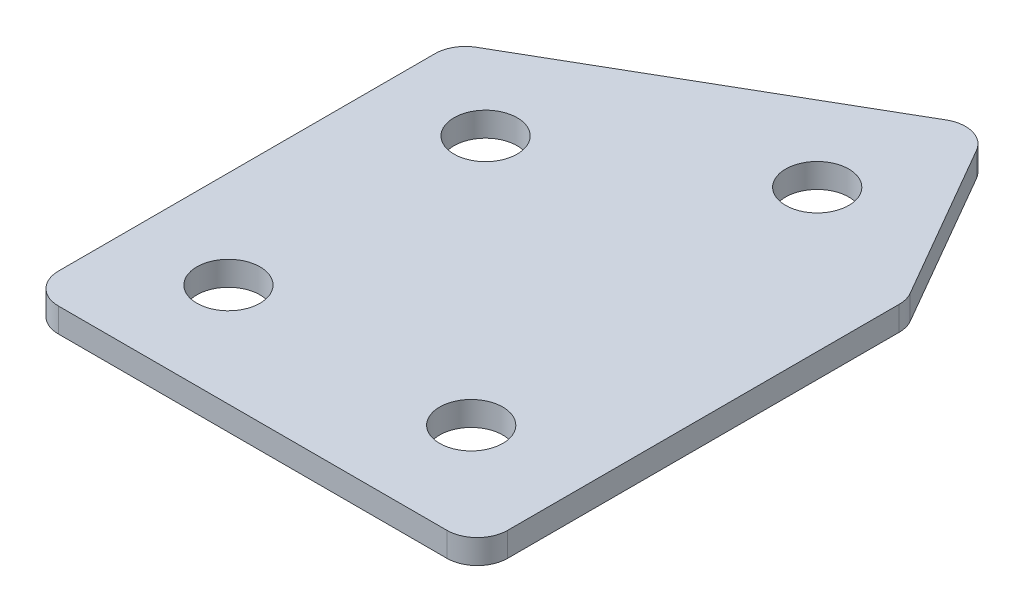
ISO-10303-21;
HEADER;
FILE_DESCRIPTION(('STEP AP214'),'2;1');
FILE_NAME('part.step','',(''),(''),'','','');
FILE_SCHEMA(('AUTOMOTIVE_DESIGN { 1 0 10303 214 1 1 1 1 }'));
ENDSEC;
DATA;
#1=APPLICATION_CONTEXT('core data for automotive mechanical design processes');
#2=APPLICATION_PROTOCOL_DEFINITION('international standard','automotive_design',2000,#1);
#3=PRODUCT_CONTEXT('',#1,'mechanical');
#4=PRODUCT('Part','Part','',(#3));
#5=PRODUCT_RELATED_PRODUCT_CATEGORY('part','',(#4));
#6=PRODUCT_DEFINITION_FORMATION('','',#4);
#7=PRODUCT_DEFINITION_CONTEXT('part definition',#1,'design');
#8=PRODUCT_DEFINITION('design','',#6,#7);
#9=PRODUCT_DEFINITION_SHAPE('','',#8);
#10=(LENGTH_UNIT() NAMED_UNIT(*) SI_UNIT(.MILLI.,.METRE.));
#11=(NAMED_UNIT(*) PLANE_ANGLE_UNIT() SI_UNIT($,.RADIAN.));
#12=(NAMED_UNIT(*) SI_UNIT($,.STERADIAN.) SOLID_ANGLE_UNIT());
#13=UNCERTAINTY_MEASURE_WITH_UNIT(LENGTH_MEASURE(1.E-05),#10,'distance_accuracy_value','');
#14=(GEOMETRIC_REPRESENTATION_CONTEXT(3) GLOBAL_UNCERTAINTY_ASSIGNED_CONTEXT((#13)) GLOBAL_UNIT_ASSIGNED_CONTEXT((#10,
#11,#12)) REPRESENTATION_CONTEXT('',''));
#15=CARTESIAN_POINT('',(0.,0.,0.));
#16=DIRECTION('',(0.,0.,1.));
#17=DIRECTION('',(1.,0.,0.));
#18=AXIS2_PLACEMENT_3D('',#15,#16,#17);
#19=CARTESIAN_POINT('',(-48.4491151304874,1.05807034313921,15.6593284465096));
#20=DIRECTION('',(0.,1.,0.));
#21=DIRECTION('',(0.,0.,1.));
#22=AXIS2_PLACEMENT_3D('',#19,#20,#21);
#23=PLANE('',#22);
#24=CARTESIAN_POINT('',(8.37139294520466,1.05807034313921,15.6593284465096));
#25=DIRECTION('',(0.,1.,0.));
#26=DIRECTION('',(0.,0.,1.));
#27=AXIS2_PLACEMENT_3D('',#24,#25,#26);
#28=CIRCLE('',#27,2.6);
#29=CARTESIAN_POINT('',(8.37139294520466,1.05807034313921,18.2593284465096));
#30=VERTEX_POINT('',#29);
#31=EDGE_CURVE('E201',#30,#30,#28,.T.);
#32=ORIENTED_EDGE('',*,*,#31,.T.);
#33=EDGE_LOOP('',(#32));
#34=FACE_BOUND('',#33,.T.);
#35=CARTESIAN_POINT('',(5.64415160925238,1.05807034313921,-15.5714336670237));
#36=DIRECTION('',(0.,1.,0.));
#37=DIRECTION('',(0.,0.,1.));
#38=AXIS2_PLACEMENT_3D('',#35,#36,#37);
#39=CIRCLE('',#38,2.6);
#40=CARTESIAN_POINT('',(5.64415160925238,1.05807034313921,-12.9714336670237));
#41=VERTEX_POINT('',#40);
#42=EDGE_CURVE('E195',#41,#41,#39,.T.);
#43=ORIENTED_EDGE('',*,*,#42,.T.);
#44=EDGE_LOOP('',(#43));
#45=FACE_BOUND('',#44,.T.);
#46=CARTESIAN_POINT('',(-11.6763564664364,1.05807034313921,-5.57143366702375));
#47=DIRECTION('',(0.,1.,0.));
#48=DIRECTION('',(0.,0.,1.));
#49=AXIS2_PLACEMENT_3D('',#46,#47,#48);
#50=CIRCLE('',#49,2.6);
#51=CARTESIAN_POINT('',(-11.6763564664364,1.05807034313921,-2.97143366702375));
#52=VERTEX_POINT('',#51);
#53=EDGE_CURVE('E189',#52,#52,#50,.T.);
#54=ORIENTED_EDGE('',*,*,#53,.T.);
#55=EDGE_LOOP('',(#54));
#56=FACE_BOUND('',#55,.T.);
#57=CARTESIAN_POINT('',(-11.6286070547953,1.05807034313921,15.6593284465096));
#58=DIRECTION('',(0.,1.,0.));
#59=DIRECTION('',(0.,0.,1.));
#60=AXIS2_PLACEMENT_3D('',#57,#58,#59);
#61=CIRCLE('',#60,2.6);
#62=CARTESIAN_POINT('',(-11.6286070547953,1.05807034313921,18.2593284465096));
#63=VERTEX_POINT('',#62);
#64=EDGE_CURVE('E115',#63,#63,#61,.T.);
#65=ORIENTED_EDGE('',*,*,#64,.T.);
#66=EDGE_LOOP('',(#65));
#67=FACE_BOUND('',#66,.T.);
#68=DIRECTION('',(0.,0.,1.));
#69=VECTOR('',#68,1.);
#70=CARTESIAN_POINT('',(-19.6286070547953,1.05807034313921,-10.7951542253953));
#71=LINE('',#70,#69);
#72=CARTESIAN_POINT('',(-19.6286070547953,1.05807034313921,-9.35177855242123));
#73=VERTEX_POINT('',#72);
#74=CARTESIAN_POINT('',(-19.6286070547953,1.05807034313921,21.6593284465097));
#75=VERTEX_POINT('',#74);
#76=EDGE_CURVE('E182',#73,#75,#71,.T.);
#77=ORIENTED_EDGE('',*,*,#76,.F.);
#78=CARTESIAN_POINT('',(-17.1286070547953,1.05807034313921,-9.35177855242123));
#79=DIRECTION('',(0.,1.,0.));
#80=DIRECTION('',(0.,0.,1.));
#81=AXIS2_PLACEMENT_3D('',#78,#79,#80);
#82=CIRCLE('',#81,2.5);
#83=CARTESIAN_POINT('',(-18.3786070547953,1.05807034313921,-11.5168420618823));
#84=VERTEX_POINT('',#83);
#85=EDGE_CURVE('E146',#73,#84,#82,.F.);
#86=ORIENTED_EDGE('',*,*,#85,.T.);
#87=DIRECTION('',(-0.866025403784438,0.,0.500000000000001));
#88=VECTOR('',#87,1.);
#89=CARTESIAN_POINT('',(8.32235483952772,1.05807034313921,-26.9326495991917));
#90=LINE('',#89,#88);
#91=CARTESIAN_POINT('',(6.15729133006662,1.05807034313921,-25.6826495991917));
#92=VERTEX_POINT('',#91);
#93=EDGE_CURVE('E174',#92,#84,#90,.T.);
#94=ORIENTED_EDGE('',*,*,#93,.F.);
#95=CARTESIAN_POINT('',(7.40729133006662,1.05807034313921,-23.5175860897306));
#96=DIRECTION('',(0.,1.,0.));
#97=DIRECTION('',(0.,0.,1.));
#98=AXIS2_PLACEMENT_3D('',#95,#96,#97);
#99=CIRCLE('',#98,2.5);
#100=CARTESIAN_POINT('',(9.57235483952772,1.05807034313921,-24.7675860897306));
#101=VERTEX_POINT('',#100);
#102=EDGE_CURVE('E118',#92,#101,#99,.F.);
#103=ORIENTED_EDGE('',*,*,#102,.T.);
#104=DIRECTION('',(-0.500000000000002,0.,-0.866025403784437));
#105=VECTOR('',#104,1.);
#106=CARTESIAN_POINT('',(17.3713929452047,1.05807034313921,-11.2592558405325));
#107=LINE('',#106,#105);
#108=CARTESIAN_POINT('',(17.0364564546657,1.05807034313921,-11.8393828594547));
#109=VERTEX_POINT('',#108);
#110=EDGE_CURVE('E119',#109,#101,#107,.T.);
#111=ORIENTED_EDGE('',*,*,#110,.F.);
#112=CARTESIAN_POINT('',(14.8713929452047,1.05807034313921,-10.5893828594547));
#113=DIRECTION('',(0.,1.,0.));
#114=DIRECTION('',(0.,0.,1.));
#115=AXIS2_PLACEMENT_3D('',#112,#113,#114);
#116=CIRCLE('',#115,2.5);
#117=CARTESIAN_POINT('',(17.3713929452047,1.05807034313921,-10.5893828594547));
#118=VERTEX_POINT('',#117);
#119=EDGE_CURVE('E141',#109,#118,#116,.F.);
#120=ORIENTED_EDGE('',*,*,#119,.T.);
#121=DIRECTION('',(0.,0.,-1.));
#122=VECTOR('',#121,1.);
#123=CARTESIAN_POINT('',(17.3713929452047,1.05807034313921,24.1593284465097));
#124=LINE('',#123,#122);
#125=CARTESIAN_POINT('',(17.3713929452047,1.05807034313921,21.6593284465097));
#126=VERTEX_POINT('',#125);
#127=EDGE_CURVE('E123',#126,#118,#124,.T.);
#128=ORIENTED_EDGE('',*,*,#127,.F.);
#129=CARTESIAN_POINT('',(14.8713929452047,1.05807034313921,21.6593284465097));
#130=DIRECTION('',(0.,1.,0.));
#131=DIRECTION('',(0.,0.,1.));
#132=AXIS2_PLACEMENT_3D('',#129,#130,#131);
#133=CIRCLE('',#132,2.5);
#134=CARTESIAN_POINT('',(14.8713929452047,1.05807034313921,24.1593284465097));
#135=VERTEX_POINT('',#134);
#136=EDGE_CURVE('E31',#126,#135,#133,.F.);
#137=ORIENTED_EDGE('',*,*,#136,.T.);
#138=DIRECTION('',(1.,0.,0.));
#139=VECTOR('',#138,1.);
#140=CARTESIAN_POINT('',(-19.6286070547953,1.05807034313921,24.1593284465097));
#141=LINE('',#140,#139);
#142=CARTESIAN_POINT('',(-17.1286070547953,1.05807034313921,24.1593284465097));
#143=VERTEX_POINT('',#142);
#144=EDGE_CURVE('E180',#143,#135,#141,.T.);
#145=ORIENTED_EDGE('',*,*,#144,.F.);
#146=CARTESIAN_POINT('',(-17.1286070547953,1.05807034313921,21.6593284465097));
#147=DIRECTION('',(0.,1.,0.));
#148=DIRECTION('',(0.,0.,1.));
#149=AXIS2_PLACEMENT_3D('',#146,#147,#148);
#150=CIRCLE('',#149,2.5);
#151=EDGE_CURVE('E144',#143,#75,#150,.F.);
#152=ORIENTED_EDGE('',*,*,#151,.T.);
#153=EDGE_LOOP('',(#77,#86,#94,#103,#111,#120,#128,#137,#145,#152));
#154=FACE_BOUND('',#153,.T.);
#155=ADVANCED_FACE('F16',(#34,#45,#56,#67,#154),#23,.F.);
#156=CARTESIAN_POINT('',(8.32235483952772,1.05807034313921,-26.9326495991917));
#157=DIRECTION('',(-0.500000000000001,0.,-0.866025403784438));
#158=DIRECTION('',(-0.866025403784438,0.,0.500000000000001));
#159=AXIS2_PLACEMENT_3D('',#156,#157,#158);
#160=PLANE('',#159);
#161=ORIENTED_EDGE('',*,*,#93,.T.);
#162=DIRECTION('',(0.,1.,0.));
#163=VECTOR('',#162,1.);
#164=CARTESIAN_POINT('',(-18.3786070547953,1.05807034313921,-11.5168420618823));
#165=LINE('',#164,#163);
#166=CARTESIAN_POINT('',(-18.3786070547953,3.05807034313921,-11.5168420618823));
#167=VERTEX_POINT('',#166);
#168=EDGE_CURVE('E105',#84,#167,#165,.T.);
#169=ORIENTED_EDGE('',*,*,#168,.T.);
#170=DIRECTION('',(-0.866025403784438,0.,0.500000000000001));
#171=VECTOR('',#170,1.);
#172=CARTESIAN_POINT('',(8.32235483952772,3.05807034313921,-26.9326495991917));
#173=LINE('',#172,#171);
#174=CARTESIAN_POINT('',(6.15729133006662,3.05807034313921,-25.6826495991917));
#175=VERTEX_POINT('',#174);
#176=EDGE_CURVE('E97',#175,#167,#173,.T.);
#177=ORIENTED_EDGE('',*,*,#176,.F.);
#178=DIRECTION('',(0.,1.,0.));
#179=VECTOR('',#178,1.);
#180=CARTESIAN_POINT('',(6.15729133006662,1.05807034313921,-25.6826495991917));
#181=LINE('',#180,#179);
#182=EDGE_CURVE('E111',#175,#92,#181,.F.);
#183=ORIENTED_EDGE('',*,*,#182,.T.);
#184=EDGE_LOOP('',(#161,#169,#177,#183));
#185=FACE_BOUND('',#184,.T.);
#186=ADVANCED_FACE('F110',(#185),#160,.T.);
#187=CARTESIAN_POINT('',(17.3713929452047,1.05807034313921,-11.2592558405325));
#188=DIRECTION('',(0.866025403784438,0.,-0.500000000000002));
#189=DIRECTION('',(-0.500000000000002,0.,-0.866025403784437));
#190=AXIS2_PLACEMENT_3D('',#187,#188,#189);
#191=PLANE('',#190);
#192=DIRECTION('',(-0.500000000000002,0.,-0.866025403784437));
#193=VECTOR('',#192,1.);
#194=CARTESIAN_POINT('',(17.3713929452047,3.05807034313921,-11.2592558405325));
#195=LINE('',#194,#193);
#196=CARTESIAN_POINT('',(17.0364564546657,3.05807034313921,-11.8393828594547));
#197=VERTEX_POINT('',#196);
#198=CARTESIAN_POINT('',(9.57235483952772,3.05807034313921,-24.7675860897306));
#199=VERTEX_POINT('',#198);
#200=EDGE_CURVE('E99',#197,#199,#195,.T.);
#201=ORIENTED_EDGE('',*,*,#200,.F.);
#202=DIRECTION('',(0.,1.,0.));
#203=VECTOR('',#202,1.);
#204=CARTESIAN_POINT('',(17.0364564546657,1.05807034313921,-11.8393828594547));
#205=LINE('',#204,#203);
#206=EDGE_CURVE('E10',#197,#109,#205,.F.);
#207=ORIENTED_EDGE('',*,*,#206,.T.);
#208=ORIENTED_EDGE('',*,*,#110,.T.);
#209=DIRECTION('',(0.,1.,0.));
#210=VECTOR('',#209,1.);
#211=CARTESIAN_POINT('',(9.57235483952772,1.05807034313921,-24.7675860897306));
#212=LINE('',#211,#210);
#213=EDGE_CURVE('E24',#101,#199,#212,.T.);
#214=ORIENTED_EDGE('',*,*,#213,.T.);
#215=EDGE_LOOP('',(#201,#207,#208,#214));
#216=FACE_BOUND('',#215,.T.);
#217=ADVANCED_FACE('F157',(#216),#191,.T.);
#218=CARTESIAN_POINT('',(17.3713929452047,1.05807034313921,24.1593284465097));
#219=DIRECTION('',(1.,0.,0.));
#220=DIRECTION('',(0.,0.,-1.));
#221=AXIS2_PLACEMENT_3D('',#218,#219,#220);
#222=PLANE('',#221);
#223=DIRECTION('',(0.,0.,-1.));
#224=VECTOR('',#223,1.);
#225=CARTESIAN_POINT('',(17.3713929452047,3.05807034313921,24.1593284465097));
#226=LINE('',#225,#224);
#227=CARTESIAN_POINT('',(17.3713929452047,3.05807034313921,21.6593284465097));
#228=VERTEX_POINT('',#227);
#229=CARTESIAN_POINT('',(17.3713929452047,3.05807034313921,-10.5893828594547));
#230=VERTEX_POINT('',#229);
#231=EDGE_CURVE('E170',#228,#230,#226,.T.);
#232=ORIENTED_EDGE('',*,*,#231,.F.);
#233=DIRECTION('',(0.,1.,0.));
#234=VECTOR('',#233,1.);
#235=CARTESIAN_POINT('',(17.3713929452047,1.05807034313921,21.6593284465097));
#236=LINE('',#235,#234);
#237=EDGE_CURVE('E155',#228,#126,#236,.F.);
#238=ORIENTED_EDGE('',*,*,#237,.T.);
#239=ORIENTED_EDGE('',*,*,#127,.T.);
#240=DIRECTION('',(0.,1.,0.));
#241=VECTOR('',#240,1.);
#242=CARTESIAN_POINT('',(17.3713929452047,1.05807034313921,-10.5893828594547));
#243=LINE('',#242,#241);
#244=EDGE_CURVE('E152',#118,#230,#243,.T.);
#245=ORIENTED_EDGE('',*,*,#244,.T.);
#246=EDGE_LOOP('',(#232,#238,#239,#245));
#247=FACE_BOUND('',#246,.T.);
#248=ADVANCED_FACE('F169',(#247),#222,.T.);
#249=CARTESIAN_POINT('',(-19.6286070547953,1.05807034313921,24.1593284465097));
#250=DIRECTION('',(0.,0.,1.));
#251=DIRECTION('',(1.,0.,0.));
#252=AXIS2_PLACEMENT_3D('',#249,#250,#251);
#253=PLANE('',#252);
#254=DIRECTION('',(1.,0.,0.));
#255=VECTOR('',#254,1.);
#256=CARTESIAN_POINT('',(-19.6286070547953,3.05807034313921,24.1593284465097));
#257=LINE('',#256,#255);
#258=CARTESIAN_POINT('',(-17.1286070547953,3.05807034313921,24.1593284465097));
#259=VERTEX_POINT('',#258);
#260=CARTESIAN_POINT('',(14.8713929452047,3.05807034313921,24.1593284465097));
#261=VERTEX_POINT('',#260);
#262=EDGE_CURVE('E173',#259,#261,#257,.T.);
#263=ORIENTED_EDGE('',*,*,#262,.F.);
#264=DIRECTION('',(0.,1.,0.));
#265=VECTOR('',#264,1.);
#266=CARTESIAN_POINT('',(-17.1286070547953,1.05807034313921,24.1593284465097));
#267=LINE('',#266,#265);
#268=EDGE_CURVE('E38',#259,#143,#267,.F.);
#269=ORIENTED_EDGE('',*,*,#268,.T.);
#270=ORIENTED_EDGE('',*,*,#144,.T.);
#271=DIRECTION('',(0.,1.,0.));
#272=VECTOR('',#271,1.);
#273=CARTESIAN_POINT('',(14.8713929452047,1.05807034313921,24.1593284465097));
#274=LINE('',#273,#272);
#275=EDGE_CURVE('E148',#135,#261,#274,.T.);
#276=ORIENTED_EDGE('',*,*,#275,.T.);
#277=EDGE_LOOP('',(#263,#269,#270,#276));
#278=FACE_BOUND('',#277,.T.);
#279=ADVANCED_FACE('F333',(#278),#253,.T.);
#280=CARTESIAN_POINT('',(-19.6286070547953,1.05807034313921,-10.7951542253953));
#281=DIRECTION('',(-1.,0.,0.));
#282=DIRECTION('',(0.,0.,1.));
#283=AXIS2_PLACEMENT_3D('',#280,#281,#282);
#284=PLANE('',#283);
#285=DIRECTION('',(0.,0.,1.));
#286=VECTOR('',#285,1.);
#287=CARTESIAN_POINT('',(-19.6286070547953,3.05807034313921,-10.7951542253953));
#288=LINE('',#287,#286);
#289=CARTESIAN_POINT('',(-19.6286070547953,3.05807034313921,-9.35177855242123));
#290=VERTEX_POINT('',#289);
#291=CARTESIAN_POINT('',(-19.6286070547953,3.05807034313921,21.6593284465097));
#292=VERTEX_POINT('',#291);
#293=EDGE_CURVE('E114',#290,#292,#288,.T.);
#294=ORIENTED_EDGE('',*,*,#293,.F.);
#295=DIRECTION('',(0.,1.,0.));
#296=VECTOR('',#295,1.);
#297=CARTESIAN_POINT('',(-19.6286070547953,1.05807034313921,-9.35177855242123));
#298=LINE('',#297,#296);
#299=EDGE_CURVE('E138',#290,#73,#298,.F.);
#300=ORIENTED_EDGE('',*,*,#299,.T.);
#301=ORIENTED_EDGE('',*,*,#76,.T.);
#302=DIRECTION('',(0.,1.,0.));
#303=VECTOR('',#302,1.);
#304=CARTESIAN_POINT('',(-19.6286070547953,1.05807034313921,21.6593284465097));
#305=LINE('',#304,#303);
#306=EDGE_CURVE('E135',#75,#292,#305,.T.);
#307=ORIENTED_EDGE('',*,*,#306,.T.);
#308=EDGE_LOOP('',(#294,#300,#301,#307));
#309=FACE_BOUND('',#308,.T.);
#310=ADVANCED_FACE('F223',(#309),#284,.T.);
#311=CARTESIAN_POINT('',(-48.4491151304874,3.05807034313921,15.6593284465096));
#312=DIRECTION('',(0.,1.,0.));
#313=DIRECTION('',(0.,0.,1.));
#314=AXIS2_PLACEMENT_3D('',#311,#312,#313);
#315=PLANE('',#314);
#316=CARTESIAN_POINT('',(8.37139294520466,3.05807034313921,15.6593284465096));
#317=DIRECTION('',(0.,1.,0.));
#318=DIRECTION('',(0.,0.,1.));
#319=AXIS2_PLACEMENT_3D('',#316,#317,#318);
#320=CIRCLE('',#319,2.6);
#321=CARTESIAN_POINT('',(8.37139294520466,3.05807034313921,18.2593284465096));
#322=VERTEX_POINT('',#321);
#323=EDGE_CURVE('E204',#322,#322,#320,.T.);
#324=ORIENTED_EDGE('',*,*,#323,.F.);
#325=EDGE_LOOP('',(#324));
#326=FACE_BOUND('',#325,.T.);
#327=CARTESIAN_POINT('',(5.64415160925238,3.05807034313921,-15.5714336670237));
#328=DIRECTION('',(0.,1.,0.));
#329=DIRECTION('',(0.,0.,1.));
#330=AXIS2_PLACEMENT_3D('',#327,#328,#329);
#331=CIRCLE('',#330,2.6);
#332=CARTESIAN_POINT('',(5.64415160925238,3.05807034313921,-12.9714336670237));
#333=VERTEX_POINT('',#332);
#334=EDGE_CURVE('E198',#333,#333,#331,.T.);
#335=ORIENTED_EDGE('',*,*,#334,.F.);
#336=EDGE_LOOP('',(#335));
#337=FACE_BOUND('',#336,.T.);
#338=CARTESIAN_POINT('',(-11.6763564664364,3.05807034313921,-5.57143366702375));
#339=DIRECTION('',(0.,1.,0.));
#340=DIRECTION('',(0.,0.,1.));
#341=AXIS2_PLACEMENT_3D('',#338,#339,#340);
#342=CIRCLE('',#341,2.6);
#343=CARTESIAN_POINT('',(-11.6763564664364,3.05807034313921,-2.97143366702375));
#344=VERTEX_POINT('',#343);
#345=EDGE_CURVE('E192',#344,#344,#342,.T.);
#346=ORIENTED_EDGE('',*,*,#345,.F.);
#347=EDGE_LOOP('',(#346));
#348=FACE_BOUND('',#347,.T.);
#349=CARTESIAN_POINT('',(-11.6286070547953,3.05807034313921,15.6593284465096));
#350=DIRECTION('',(0.,1.,0.));
#351=DIRECTION('',(0.,0.,1.));
#352=AXIS2_PLACEMENT_3D('',#349,#350,#351);
#353=CIRCLE('',#352,2.6);
#354=CARTESIAN_POINT('',(-11.6286070547953,3.05807034313921,18.2593284465096));
#355=VERTEX_POINT('',#354);
#356=EDGE_CURVE('E186',#355,#355,#353,.T.);
#357=ORIENTED_EDGE('',*,*,#356,.F.);
#358=EDGE_LOOP('',(#357));
#359=FACE_BOUND('',#358,.T.);
#360=ORIENTED_EDGE('',*,*,#176,.T.);
#361=CARTESIAN_POINT('',(-17.1286070547953,3.05807034313921,-9.35177855242123));
#362=DIRECTION('',(0.,1.,0.));
#363=DIRECTION('',(0.,0.,1.));
#364=AXIS2_PLACEMENT_3D('',#361,#362,#363);
#365=CIRCLE('',#364,2.5);
#366=EDGE_CURVE('E133',#167,#290,#365,.T.);
#367=ORIENTED_EDGE('',*,*,#366,.T.);
#368=ORIENTED_EDGE('',*,*,#293,.T.);
#369=CARTESIAN_POINT('',(-17.1286070547953,3.05807034313921,21.6593284465097));
#370=DIRECTION('',(0.,1.,0.));
#371=DIRECTION('',(0.,0.,1.));
#372=AXIS2_PLACEMENT_3D('',#369,#370,#371);
#373=CIRCLE('',#372,2.5);
#374=EDGE_CURVE('E131',#292,#259,#373,.T.);
#375=ORIENTED_EDGE('',*,*,#374,.T.);
#376=ORIENTED_EDGE('',*,*,#262,.T.);
#377=CARTESIAN_POINT('',(14.8713929452047,3.05807034313921,21.6593284465097));
#378=DIRECTION('',(0.,1.,0.));
#379=DIRECTION('',(0.,0.,1.));
#380=AXIS2_PLACEMENT_3D('',#377,#378,#379);
#381=CIRCLE('',#380,2.5);
#382=EDGE_CURVE('E129',#261,#228,#381,.T.);
#383=ORIENTED_EDGE('',*,*,#382,.T.);
#384=ORIENTED_EDGE('',*,*,#231,.T.);
#385=CARTESIAN_POINT('',(14.8713929452047,3.05807034313921,-10.5893828594547));
#386=DIRECTION('',(0.,1.,0.));
#387=DIRECTION('',(0.,0.,1.));
#388=AXIS2_PLACEMENT_3D('',#385,#386,#387);
#389=CIRCLE('',#388,2.5);
#390=EDGE_CURVE('E104',#230,#197,#389,.T.);
#391=ORIENTED_EDGE('',*,*,#390,.T.);
#392=ORIENTED_EDGE('',*,*,#200,.T.);
#393=CARTESIAN_POINT('',(7.40729133006662,3.05807034313921,-23.5175860897306));
#394=DIRECTION('',(0.,1.,0.));
#395=DIRECTION('',(0.,0.,1.));
#396=AXIS2_PLACEMENT_3D('',#393,#394,#395);
#397=CIRCLE('',#396,2.5);
#398=EDGE_CURVE('E94',#199,#175,#397,.T.);
#399=ORIENTED_EDGE('',*,*,#398,.T.);
#400=EDGE_LOOP('',(#360,#367,#368,#375,#376,#383,#384,#391,#392,#399));
#401=FACE_BOUND('',#400,.T.);
#402=ADVANCED_FACE('F96',(#326,#337,#348,#359,#401),#315,.T.);
#403=CARTESIAN_POINT('',(-11.6286070547953,1.05807034313921,15.6593284465096));
#404=DIRECTION('',(0.,1.,0.));
#405=DIRECTION('',(0.,0.,1.));
#406=AXIS2_PLACEMENT_3D('',#403,#404,#405);
#407=CYLINDRICAL_SURFACE('',#406,2.6);
#408=ORIENTED_EDGE('',*,*,#64,.F.);
#409=EDGE_LOOP('',(#408));
#410=FACE_BOUND('',#409,.T.);
#411=ORIENTED_EDGE('',*,*,#356,.T.);
#412=EDGE_LOOP('',(#411));
#413=FACE_BOUND('',#412,.T.);
#414=ADVANCED_FACE('F222',(#410,#413),#407,.F.);
#415=CARTESIAN_POINT('',(-11.6763564664364,1.05807034313921,-5.57143366702375));
#416=DIRECTION('',(0.,1.,0.));
#417=DIRECTION('',(0.,0.,1.));
#418=AXIS2_PLACEMENT_3D('',#415,#416,#417);
#419=CYLINDRICAL_SURFACE('',#418,2.6);
#420=ORIENTED_EDGE('',*,*,#53,.F.);
#421=EDGE_LOOP('',(#420));
#422=FACE_BOUND('',#421,.T.);
#423=ORIENTED_EDGE('',*,*,#345,.T.);
#424=EDGE_LOOP('',(#423));
#425=FACE_BOUND('',#424,.T.);
#426=ADVANCED_FACE('F232',(#422,#425),#419,.F.);
#427=CARTESIAN_POINT('',(5.64415160925238,1.05807034313921,-15.5714336670237));
#428=DIRECTION('',(0.,1.,0.));
#429=DIRECTION('',(0.,0.,1.));
#430=AXIS2_PLACEMENT_3D('',#427,#428,#429);
#431=CYLINDRICAL_SURFACE('',#430,2.6);
#432=ORIENTED_EDGE('',*,*,#42,.F.);
#433=EDGE_LOOP('',(#432));
#434=FACE_BOUND('',#433,.T.);
#435=ORIENTED_EDGE('',*,*,#334,.T.);
#436=EDGE_LOOP('',(#435));
#437=FACE_BOUND('',#436,.T.);
#438=ADVANCED_FACE('F216',(#434,#437),#431,.F.);
#439=CARTESIAN_POINT('',(8.37139294520466,1.05807034313921,15.6593284465096));
#440=DIRECTION('',(0.,1.,0.));
#441=DIRECTION('',(0.,0.,1.));
#442=AXIS2_PLACEMENT_3D('',#439,#440,#441);
#443=CYLINDRICAL_SURFACE('',#442,2.6);
#444=ORIENTED_EDGE('',*,*,#31,.F.);
#445=EDGE_LOOP('',(#444));
#446=FACE_BOUND('',#445,.T.);
#447=ORIENTED_EDGE('',*,*,#323,.T.);
#448=EDGE_LOOP('',(#447));
#449=FACE_BOUND('',#448,.T.);
#450=ADVANCED_FACE('F212',(#446,#449),#443,.F.);
#451=CARTESIAN_POINT('',(-17.1286070547953,1.05807034313921,-9.35177855242123));
#452=DIRECTION('',(0.,1.,0.));
#453=DIRECTION('',(0.,0.,1.));
#454=AXIS2_PLACEMENT_3D('',#451,#452,#453);
#455=CYLINDRICAL_SURFACE('',#454,2.5);
#456=ORIENTED_EDGE('',*,*,#85,.F.);
#457=ORIENTED_EDGE('',*,*,#299,.F.);
#458=ORIENTED_EDGE('',*,*,#366,.F.);
#459=ORIENTED_EDGE('',*,*,#168,.F.);
#460=EDGE_LOOP('',(#456,#457,#458,#459));
#461=FACE_BOUND('',#460,.T.);
#462=ADVANCED_FACE('F215',(#461),#455,.T.);
#463=CARTESIAN_POINT('',(-17.1286070547953,1.05807034313921,21.6593284465097));
#464=DIRECTION('',(0.,1.,0.));
#465=DIRECTION('',(0.,0.,1.));
#466=AXIS2_PLACEMENT_3D('',#463,#464,#465);
#467=CYLINDRICAL_SURFACE('',#466,2.5);
#468=ORIENTED_EDGE('',*,*,#151,.F.);
#469=ORIENTED_EDGE('',*,*,#268,.F.);
#470=ORIENTED_EDGE('',*,*,#374,.F.);
#471=ORIENTED_EDGE('',*,*,#306,.F.);
#472=EDGE_LOOP('',(#468,#469,#470,#471));
#473=FACE_BOUND('',#472,.T.);
#474=ADVANCED_FACE('F252',(#473),#467,.T.);
#475=CARTESIAN_POINT('',(14.8713929452047,1.05807034313921,21.6593284465097));
#476=DIRECTION('',(0.,1.,0.));
#477=DIRECTION('',(0.,0.,1.));
#478=AXIS2_PLACEMENT_3D('',#475,#476,#477);
#479=CYLINDRICAL_SURFACE('',#478,2.5);
#480=ORIENTED_EDGE('',*,*,#136,.F.);
#481=ORIENTED_EDGE('',*,*,#237,.F.);
#482=ORIENTED_EDGE('',*,*,#382,.F.);
#483=ORIENTED_EDGE('',*,*,#275,.F.);
#484=EDGE_LOOP('',(#480,#481,#482,#483));
#485=FACE_BOUND('',#484,.T.);
#486=ADVANCED_FACE('F256',(#485),#479,.T.);
#487=CARTESIAN_POINT('',(14.8713929452047,1.05807034313921,-10.5893828594547));
#488=DIRECTION('',(0.,1.,0.));
#489=DIRECTION('',(0.,0.,1.));
#490=AXIS2_PLACEMENT_3D('',#487,#488,#489);
#491=CYLINDRICAL_SURFACE('',#490,2.5);
#492=ORIENTED_EDGE('',*,*,#119,.F.);
#493=ORIENTED_EDGE('',*,*,#206,.F.);
#494=ORIENTED_EDGE('',*,*,#390,.F.);
#495=ORIENTED_EDGE('',*,*,#244,.F.);
#496=EDGE_LOOP('',(#492,#493,#494,#495));
#497=FACE_BOUND('',#496,.T.);
#498=ADVANCED_FACE('F165',(#497),#491,.T.);
#499=CARTESIAN_POINT('',(7.40729133006662,1.05807034313921,-23.5175860897306));
#500=DIRECTION('',(0.,1.,0.));
#501=DIRECTION('',(0.,0.,1.));
#502=AXIS2_PLACEMENT_3D('',#499,#500,#501);
#503=CYLINDRICAL_SURFACE('',#502,2.5);
#504=ORIENTED_EDGE('',*,*,#102,.F.);
#505=ORIENTED_EDGE('',*,*,#182,.F.);
#506=ORIENTED_EDGE('',*,*,#398,.F.);
#507=ORIENTED_EDGE('',*,*,#213,.F.);
#508=EDGE_LOOP('',(#504,#505,#506,#507));
#509=FACE_BOUND('',#508,.T.);
#510=ADVANCED_FACE('F18',(#509),#503,.T.);
#511=CLOSED_SHELL('',(#155,#186,#217,#248,#279,#310,#402,#414,#426,#438,#450,#462,#474,#486,
#498,#510));
#512=MANIFOLD_SOLID_BREP('B1',#511);
#513=ADVANCED_BREP_SHAPE_REPRESENTATION('',(#18,#512),#14);
#514=SHAPE_DEFINITION_REPRESENTATION(#9,#513);
ENDSEC;
END-ISO-10303-21;
